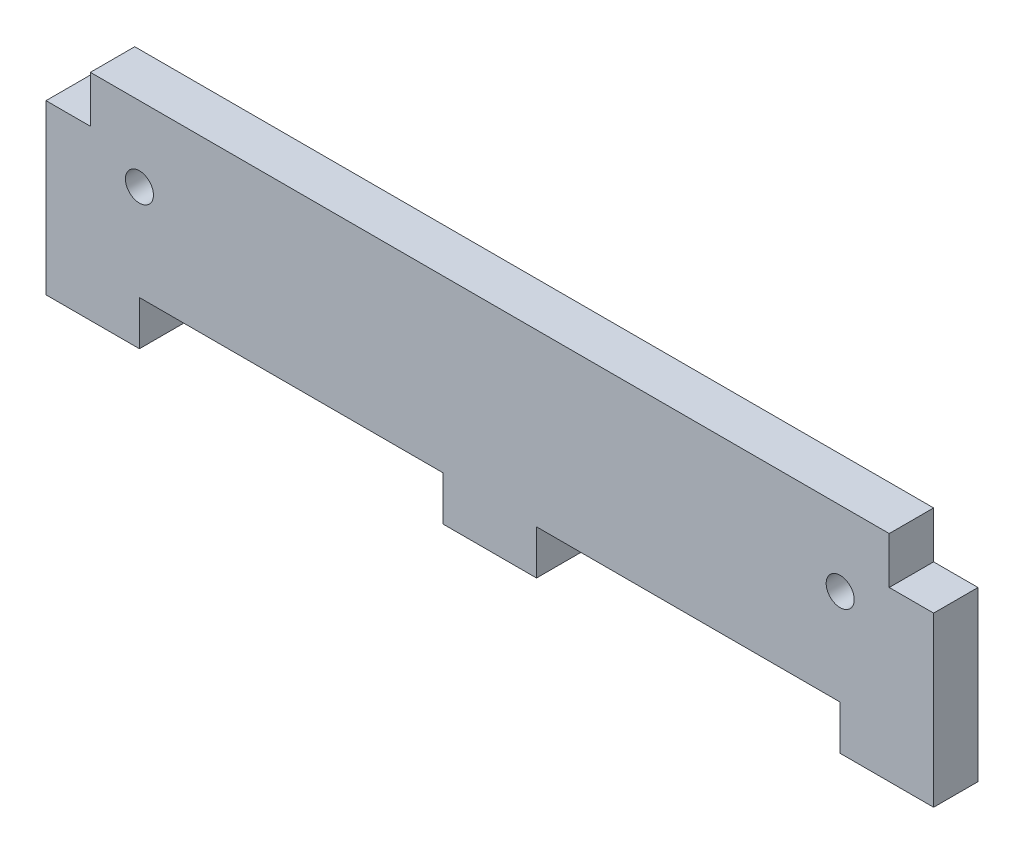
ISO-10303-21;
HEADER;
FILE_DESCRIPTION(('STEP AP214'),'2;1');
FILE_NAME('part.step','',(''),(''),'','','');
FILE_SCHEMA(('AUTOMOTIVE_DESIGN { 1 0 10303 214 1 1 1 1 }'));
ENDSEC;
DATA;
#1=APPLICATION_CONTEXT('core data for automotive mechanical design processes');
#2=APPLICATION_PROTOCOL_DEFINITION('international standard','automotive_design',2000,#1);
#3=PRODUCT_CONTEXT('',#1,'mechanical');
#4=PRODUCT('Part','Part','',(#3));
#5=PRODUCT_RELATED_PRODUCT_CATEGORY('part','',(#4));
#6=PRODUCT_DEFINITION_FORMATION('','',#4);
#7=PRODUCT_DEFINITION_CONTEXT('part definition',#1,'design');
#8=PRODUCT_DEFINITION('design','',#6,#7);
#9=PRODUCT_DEFINITION_SHAPE('','',#8);
#10=(LENGTH_UNIT() NAMED_UNIT(*) SI_UNIT(.MILLI.,.METRE.));
#11=(NAMED_UNIT(*) PLANE_ANGLE_UNIT() SI_UNIT($,.RADIAN.));
#12=(NAMED_UNIT(*) SI_UNIT($,.STERADIAN.) SOLID_ANGLE_UNIT());
#13=UNCERTAINTY_MEASURE_WITH_UNIT(LENGTH_MEASURE(1.E-05),#10,'distance_accuracy_value','');
#14=(GEOMETRIC_REPRESENTATION_CONTEXT(3) GLOBAL_UNCERTAINTY_ASSIGNED_CONTEXT((#13)) GLOBAL_UNIT_ASSIGNED_CONTEXT((#10,
#11,#12)) REPRESENTATION_CONTEXT('',''));
#15=CARTESIAN_POINT('',(0.,0.,0.));
#16=DIRECTION('',(0.,0.,1.));
#17=DIRECTION('',(1.,0.,0.));
#18=AXIS2_PLACEMENT_3D('',#15,#16,#17);
#19=CARTESIAN_POINT('',(0.,0.,4.75));
#20=DIRECTION('',(0.,1.,0.));
#21=DIRECTION('',(0.,0.,1.));
#22=AXIS2_PLACEMENT_3D('',#19,#20,#21);
#23=PLANE('',#22);
#24=DIRECTION('',(1.,0.,0.));
#25=VECTOR('',#24,1.);
#26=CARTESIAN_POINT('',(0.,0.,0.));
#27=LINE('',#26,#25);
#28=CARTESIAN_POINT('',(0.,0.,0.));
#29=VERTEX_POINT('',#28);
#30=CARTESIAN_POINT('',(10.,0.,0.));
#31=VERTEX_POINT('',#30);
#32=EDGE_CURVE('E166',#29,#31,#27,.T.);
#33=ORIENTED_EDGE('',*,*,#32,.T.);
#34=DIRECTION('',(0.,0.,1.));
#35=VECTOR('',#34,1.);
#36=CARTESIAN_POINT('',(10.,0.,0.));
#37=LINE('',#36,#35);
#38=CARTESIAN_POINT('',(10.,0.,4.75));
#39=VERTEX_POINT('',#38);
#40=EDGE_CURVE('E231',#31,#39,#37,.T.);
#41=ORIENTED_EDGE('',*,*,#40,.T.);
#42=DIRECTION('',(1.,0.,0.));
#43=VECTOR('',#42,1.);
#44=CARTESIAN_POINT('',(0.,0.,4.75));
#45=LINE('',#44,#43);
#46=CARTESIAN_POINT('',(0.,0.,4.75));
#47=VERTEX_POINT('',#46);
#48=EDGE_CURVE('E195',#47,#39,#45,.T.);
#49=ORIENTED_EDGE('',*,*,#48,.F.);
#50=DIRECTION('',(0.,0.,-1.));
#51=VECTOR('',#50,1.);
#52=CARTESIAN_POINT('',(0.,0.,4.75));
#53=LINE('',#52,#51);
#54=EDGE_CURVE('E11',#47,#29,#53,.T.);
#55=ORIENTED_EDGE('',*,*,#54,.T.);
#56=EDGE_LOOP('',(#33,#41,#49,#55));
#57=FACE_BOUND('',#56,.T.);
#58=ADVANCED_FACE('F32',(#57),#23,.F.);
#59=CARTESIAN_POINT('',(42.5,0.,4.75));
#60=VERTEX_POINT('',#59);
#61=CARTESIAN_POINT('',(52.5,0.,4.75));
#62=VERTEX_POINT('',#61);
#63=EDGE_CURVE('E198',#60,#62,#45,.T.);
#64=ORIENTED_EDGE('',*,*,#63,.F.);
#65=DIRECTION('',(0.,0.,1.));
#66=VECTOR('',#65,1.);
#67=CARTESIAN_POINT('',(42.5,0.,0.));
#68=LINE('',#67,#66);
#69=CARTESIAN_POINT('',(42.5,0.,0.));
#70=VERTEX_POINT('',#69);
#71=EDGE_CURVE('E234',#70,#60,#68,.T.);
#72=ORIENTED_EDGE('',*,*,#71,.F.);
#73=CARTESIAN_POINT('',(52.5,0.,0.));
#74=VERTEX_POINT('',#73);
#75=EDGE_CURVE('E170',#70,#74,#27,.T.);
#76=ORIENTED_EDGE('',*,*,#75,.T.);
#77=DIRECTION('',(0.,0.,1.));
#78=VECTOR('',#77,1.);
#79=CARTESIAN_POINT('',(52.5,0.,0.));
#80=LINE('',#79,#78);
#81=EDGE_CURVE('E203',#74,#62,#80,.T.);
#82=ORIENTED_EDGE('',*,*,#81,.T.);
#83=EDGE_LOOP('',(#64,#72,#76,#82));
#84=FACE_BOUND('',#83,.T.);
#85=ADVANCED_FACE('F316',(#84),#23,.F.);
#86=CARTESIAN_POINT('',(0.,0.,4.75));
#87=DIRECTION('',(1.,0.,0.));
#88=DIRECTION('',(0.,0.,-1.));
#89=AXIS2_PLACEMENT_3D('',#86,#87,#88);
#90=PLANE('',#89);
#91=DIRECTION('',(0.,-1.,0.));
#92=VECTOR('',#91,1.);
#93=CARTESIAN_POINT('',(0.,0.,4.75));
#94=LINE('',#93,#92);
#95=CARTESIAN_POINT('',(0.,18.,4.75));
#96=VERTEX_POINT('',#95);
#97=EDGE_CURVE('E160',#96,#47,#94,.T.);
#98=ORIENTED_EDGE('',*,*,#97,.F.);
#99=DIRECTION('',(0.,0.,1.));
#100=VECTOR('',#99,1.);
#101=CARTESIAN_POINT('',(0.,18.,0.));
#102=LINE('',#101,#100);
#103=CARTESIAN_POINT('',(0.,18.,0.));
#104=VERTEX_POINT('',#103);
#105=EDGE_CURVE('E148',#104,#96,#102,.T.);
#106=ORIENTED_EDGE('',*,*,#105,.F.);
#107=DIRECTION('',(0.,-1.,0.));
#108=VECTOR('',#107,1.);
#109=CARTESIAN_POINT('',(0.,0.,0.));
#110=LINE('',#109,#108);
#111=EDGE_CURVE('E158',#104,#29,#110,.T.);
#112=ORIENTED_EDGE('',*,*,#111,.T.);
#113=ORIENTED_EDGE('',*,*,#54,.F.);
#114=EDGE_LOOP('',(#98,#106,#112,#113));
#115=FACE_BOUND('',#114,.T.);
#116=ADVANCED_FACE('F34',(#115),#90,.F.);
#117=CARTESIAN_POINT('',(85.,0.,4.75));
#118=VERTEX_POINT('',#117);
#119=CARTESIAN_POINT('',(95.,0.,4.75));
#120=VERTEX_POINT('',#119);
#121=EDGE_CURVE('E200',#118,#120,#45,.T.);
#122=ORIENTED_EDGE('',*,*,#121,.F.);
#123=DIRECTION('',(0.,0.,1.));
#124=VECTOR('',#123,1.);
#125=CARTESIAN_POINT('',(85.,0.,0.));
#126=LINE('',#125,#124);
#127=CARTESIAN_POINT('',(85.,0.,0.));
#128=VERTEX_POINT('',#127);
#129=EDGE_CURVE('E206',#128,#118,#126,.T.);
#130=ORIENTED_EDGE('',*,*,#129,.F.);
#131=CARTESIAN_POINT('',(95.,0.,0.));
#132=VERTEX_POINT('',#131);
#133=EDGE_CURVE('E167',#128,#132,#27,.T.);
#134=ORIENTED_EDGE('',*,*,#133,.T.);
#135=DIRECTION('',(0.,0.,-1.));
#136=VECTOR('',#135,1.);
#137=CARTESIAN_POINT('',(95.,0.,4.75));
#138=LINE('',#137,#136);
#139=EDGE_CURVE('E40',#120,#132,#138,.T.);
#140=ORIENTED_EDGE('',*,*,#139,.F.);
#141=EDGE_LOOP('',(#122,#130,#134,#140));
#142=FACE_BOUND('',#141,.T.);
#143=ADVANCED_FACE('F299',(#142),#23,.F.);
#144=CARTESIAN_POINT('',(95.,0.,4.75));
#145=DIRECTION('',(-1.,0.,0.));
#146=DIRECTION('',(0.,0.,1.));
#147=AXIS2_PLACEMENT_3D('',#144,#145,#146);
#148=PLANE('',#147);
#149=DIRECTION('',(0.,1.,0.));
#150=VECTOR('',#149,1.);
#151=CARTESIAN_POINT('',(95.,0.,0.));
#152=LINE('',#151,#150);
#153=CARTESIAN_POINT('',(95.,18.,0.));
#154=VERTEX_POINT('',#153);
#155=EDGE_CURVE('E178',#132,#154,#152,.T.);
#156=ORIENTED_EDGE('',*,*,#155,.T.);
#157=DIRECTION('',(0.,0.,1.));
#158=VECTOR('',#157,1.);
#159=CARTESIAN_POINT('',(95.,18.,0.));
#160=LINE('',#159,#158);
#161=CARTESIAN_POINT('',(95.,18.,4.75));
#162=VERTEX_POINT('',#161);
#163=EDGE_CURVE('E268',#154,#162,#160,.T.);
#164=ORIENTED_EDGE('',*,*,#163,.T.);
#165=DIRECTION('',(0.,1.,0.));
#166=VECTOR('',#165,1.);
#167=CARTESIAN_POINT('',(95.,0.,4.75));
#168=LINE('',#167,#166);
#169=EDGE_CURVE('E189',#120,#162,#168,.T.);
#170=ORIENTED_EDGE('',*,*,#169,.F.);
#171=ORIENTED_EDGE('',*,*,#139,.T.);
#172=EDGE_LOOP('',(#156,#164,#170,#171));
#173=FACE_BOUND('',#172,.T.);
#174=ADVANCED_FACE('F294',(#173),#148,.F.);
#175=CARTESIAN_POINT('',(0.,23.,4.75));
#176=DIRECTION('',(0.,-1.,0.));
#177=DIRECTION('',(0.,0.,-1.));
#178=AXIS2_PLACEMENT_3D('',#175,#176,#177);
#179=PLANE('',#178);
#180=DIRECTION('',(-1.,0.,0.));
#181=VECTOR('',#180,1.);
#182=CARTESIAN_POINT('',(0.,23.,0.));
#183=LINE('',#182,#181);
#184=CARTESIAN_POINT('',(90.25,23.,0.));
#185=VERTEX_POINT('',#184);
#186=CARTESIAN_POINT('',(4.75,23.,0.));
#187=VERTEX_POINT('',#186);
#188=EDGE_CURVE('E181',#185,#187,#183,.T.);
#189=ORIENTED_EDGE('',*,*,#188,.T.);
#190=DIRECTION('',(0.,0.,1.));
#191=VECTOR('',#190,1.);
#192=CARTESIAN_POINT('',(4.75,23.,0.));
#193=LINE('',#192,#191);
#194=CARTESIAN_POINT('',(4.75,23.,4.75));
#195=VERTEX_POINT('',#194);
#196=EDGE_CURVE('E256',#187,#195,#193,.T.);
#197=ORIENTED_EDGE('',*,*,#196,.T.);
#198=DIRECTION('',(-1.,0.,0.));
#199=VECTOR('',#198,1.);
#200=CARTESIAN_POINT('',(0.,23.,4.75));
#201=LINE('',#200,#199);
#202=CARTESIAN_POINT('',(90.25,23.,4.75));
#203=VERTEX_POINT('',#202);
#204=EDGE_CURVE('E175',#203,#195,#201,.T.);
#205=ORIENTED_EDGE('',*,*,#204,.F.);
#206=DIRECTION('',(0.,0.,1.));
#207=VECTOR('',#206,1.);
#208=CARTESIAN_POINT('',(90.25,23.,0.));
#209=LINE('',#208,#207);
#210=EDGE_CURVE('E264',#185,#203,#209,.T.);
#211=ORIENTED_EDGE('',*,*,#210,.F.);
#212=EDGE_LOOP('',(#189,#197,#205,#211));
#213=FACE_BOUND('',#212,.T.);
#214=ADVANCED_FACE('F289',(#213),#179,.F.);
#215=CARTESIAN_POINT('',(0.,0.,4.75));
#216=DIRECTION('',(0.,0.,-1.));
#217=DIRECTION('',(-1.,0.,0.));
#218=AXIS2_PLACEMENT_3D('',#215,#216,#217);
#219=PLANE('',#218);
#220=CARTESIAN_POINT('',(9.99999999999999,15.,4.75));
#221=DIRECTION('',(0.,0.,1.));
#222=DIRECTION('',(1.,0.,0.));
#223=AXIS2_PLACEMENT_3D('',#220,#221,#222);
#224=CIRCLE('',#223,1.5);
#225=CARTESIAN_POINT('',(11.5,15.,4.75));
#226=VERTEX_POINT('',#225);
#227=EDGE_CURVE('E259',#226,#226,#224,.T.);
#228=ORIENTED_EDGE('',*,*,#227,.F.);
#229=EDGE_LOOP('',(#228));
#230=FACE_BOUND('',#229,.T.);
#231=CARTESIAN_POINT('',(85.,15.,4.75));
#232=DIRECTION('',(0.,0.,1.));
#233=DIRECTION('',(1.,0.,0.));
#234=AXIS2_PLACEMENT_3D('',#231,#232,#233);
#235=CIRCLE('',#234,1.5);
#236=CARTESIAN_POINT('',(86.5,15.,4.75));
#237=VERTEX_POINT('',#236);
#238=EDGE_CURVE('E252',#237,#237,#235,.T.);
#239=ORIENTED_EDGE('',*,*,#238,.F.);
#240=EDGE_LOOP('',(#239));
#241=FACE_BOUND('',#240,.T.);
#242=ORIENTED_EDGE('',*,*,#204,.T.);
#243=DIRECTION('',(0.,1.,0.));
#244=VECTOR('',#243,1.);
#245=CARTESIAN_POINT('',(4.75,23.,4.75));
#246=LINE('',#245,#244);
#247=CARTESIAN_POINT('',(4.75,18.,4.75));
#248=VERTEX_POINT('',#247);
#249=EDGE_CURVE('E153',#248,#195,#246,.T.);
#250=ORIENTED_EDGE('',*,*,#249,.F.);
#251=DIRECTION('',(1.,0.,0.));
#252=VECTOR('',#251,1.);
#253=CARTESIAN_POINT('',(0.,18.,4.75));
#254=LINE('',#253,#252);
#255=EDGE_CURVE('E271',#96,#248,#254,.T.);
#256=ORIENTED_EDGE('',*,*,#255,.F.);
#257=ORIENTED_EDGE('',*,*,#97,.T.);
#258=ORIENTED_EDGE('',*,*,#48,.T.);
#259=DIRECTION('',(0.,-1.,0.));
#260=VECTOR('',#259,1.);
#261=CARTESIAN_POINT('',(10.,0.,4.75));
#262=LINE('',#261,#260);
#263=CARTESIAN_POINT('',(10.,4.75,4.75));
#264=VERTEX_POINT('',#263);
#265=EDGE_CURVE('E213',#264,#39,#262,.T.);
#266=ORIENTED_EDGE('',*,*,#265,.F.);
#267=DIRECTION('',(-1.,0.,0.));
#268=VECTOR('',#267,1.);
#269=CARTESIAN_POINT('',(10.,4.75,4.75));
#270=LINE('',#269,#268);
#271=CARTESIAN_POINT('',(42.5,4.75,4.75));
#272=VERTEX_POINT('',#271);
#273=EDGE_CURVE('E238',#272,#264,#270,.T.);
#274=ORIENTED_EDGE('',*,*,#273,.F.);
#275=DIRECTION('',(0.,1.,0.));
#276=VECTOR('',#275,1.);
#277=CARTESIAN_POINT('',(42.5,0.,4.75));
#278=LINE('',#277,#276);
#279=EDGE_CURVE('E242',#60,#272,#278,.T.);
#280=ORIENTED_EDGE('',*,*,#279,.F.);
#281=ORIENTED_EDGE('',*,*,#63,.T.);
#282=DIRECTION('',(0.,-1.,0.));
#283=VECTOR('',#282,1.);
#284=CARTESIAN_POINT('',(52.5,0.,4.75));
#285=LINE('',#284,#283);
#286=CARTESIAN_POINT('',(52.5,4.75,4.75));
#287=VERTEX_POINT('',#286);
#288=EDGE_CURVE('E221',#287,#62,#285,.T.);
#289=ORIENTED_EDGE('',*,*,#288,.F.);
#290=DIRECTION('',(-1.,0.,0.));
#291=VECTOR('',#290,1.);
#292=CARTESIAN_POINT('',(52.5,4.75,4.75));
#293=LINE('',#292,#291);
#294=CARTESIAN_POINT('',(85.,4.75,4.75));
#295=VERTEX_POINT('',#294);
#296=EDGE_CURVE('E214',#295,#287,#293,.T.);
#297=ORIENTED_EDGE('',*,*,#296,.F.);
#298=DIRECTION('',(0.,1.,0.));
#299=VECTOR('',#298,1.);
#300=CARTESIAN_POINT('',(85.,0.,4.75));
#301=LINE('',#300,#299);
#302=EDGE_CURVE('E218',#118,#295,#301,.T.);
#303=ORIENTED_EDGE('',*,*,#302,.F.);
#304=ORIENTED_EDGE('',*,*,#121,.T.);
#305=ORIENTED_EDGE('',*,*,#169,.T.);
#306=DIRECTION('',(1.,0.,0.));
#307=VECTOR('',#306,1.);
#308=CARTESIAN_POINT('',(95.,18.,4.75));
#309=LINE('',#308,#307);
#310=CARTESIAN_POINT('',(90.25,18.,4.75));
#311=VERTEX_POINT('',#310);
#312=EDGE_CURVE('E272',#311,#162,#309,.T.);
#313=ORIENTED_EDGE('',*,*,#312,.F.);
#314=DIRECTION('',(0.,-1.,0.));
#315=VECTOR('',#314,1.);
#316=CARTESIAN_POINT('',(90.25,23.,4.75));
#317=LINE('',#316,#315);
#318=EDGE_CURVE('E275',#203,#311,#317,.T.);
#319=ORIENTED_EDGE('',*,*,#318,.F.);
#320=EDGE_LOOP('',(#242,#250,#256,#257,#258,#266,#274,#280,#281,#289,#297,#303,#304,#305,#313,#319));
#321=FACE_BOUND('',#320,.T.);
#322=ADVANCED_FACE('F292',(#230,#241,#321),#219,.F.);
#323=CARTESIAN_POINT('',(0.,0.,0.));
#324=DIRECTION('',(0.,0.,-1.));
#325=DIRECTION('',(-1.,0.,0.));
#326=AXIS2_PLACEMENT_3D('',#323,#324,#325);
#327=PLANE('',#326);
#328=DIRECTION('',(0.,1.,0.));
#329=VECTOR('',#328,1.);
#330=CARTESIAN_POINT('',(4.75,23.,0.));
#331=LINE('',#330,#329);
#332=CARTESIAN_POINT('',(4.75,18.,0.));
#333=VERTEX_POINT('',#332);
#334=EDGE_CURVE('E47',#333,#187,#331,.T.);
#335=ORIENTED_EDGE('',*,*,#334,.T.);
#336=ORIENTED_EDGE('',*,*,#188,.F.);
#337=DIRECTION('',(0.,-1.,0.));
#338=VECTOR('',#337,1.);
#339=CARTESIAN_POINT('',(90.25,23.,0.));
#340=LINE('',#339,#338);
#341=CARTESIAN_POINT('',(90.25,18.,0.));
#342=VERTEX_POINT('',#341);
#343=EDGE_CURVE('E274',#185,#342,#340,.T.);
#344=ORIENTED_EDGE('',*,*,#343,.T.);
#345=DIRECTION('',(1.,0.,0.));
#346=VECTOR('',#345,1.);
#347=CARTESIAN_POINT('',(95.,18.,0.));
#348=LINE('',#347,#346);
#349=EDGE_CURVE('E55',#342,#154,#348,.T.);
#350=ORIENTED_EDGE('',*,*,#349,.T.);
#351=ORIENTED_EDGE('',*,*,#155,.F.);
#352=ORIENTED_EDGE('',*,*,#133,.F.);
#353=DIRECTION('',(0.,1.,0.));
#354=VECTOR('',#353,1.);
#355=CARTESIAN_POINT('',(85.,0.,0.));
#356=LINE('',#355,#354);
#357=CARTESIAN_POINT('',(85.,4.75,0.));
#358=VERTEX_POINT('',#357);
#359=EDGE_CURVE('E226',#128,#358,#356,.T.);
#360=ORIENTED_EDGE('',*,*,#359,.T.);
#361=DIRECTION('',(-1.,0.,0.));
#362=VECTOR('',#361,1.);
#363=CARTESIAN_POINT('',(52.5,4.75,0.));
#364=LINE('',#363,#362);
#365=CARTESIAN_POINT('',(52.5,4.75,0.));
#366=VERTEX_POINT('',#365);
#367=EDGE_CURVE('E207',#358,#366,#364,.T.);
#368=ORIENTED_EDGE('',*,*,#367,.T.);
#369=DIRECTION('',(0.,-1.,0.));
#370=VECTOR('',#369,1.);
#371=CARTESIAN_POINT('',(52.5,0.,0.));
#372=LINE('',#371,#370);
#373=EDGE_CURVE('E217',#366,#74,#372,.T.);
#374=ORIENTED_EDGE('',*,*,#373,.T.);
#375=ORIENTED_EDGE('',*,*,#75,.F.);
#376=DIRECTION('',(0.,1.,0.));
#377=VECTOR('',#376,1.);
#378=CARTESIAN_POINT('',(42.5,0.,0.));
#379=LINE('',#378,#377);
#380=CARTESIAN_POINT('',(42.5,4.75,0.));
#381=VERTEX_POINT('',#380);
#382=EDGE_CURVE('E248',#70,#381,#379,.T.);
#383=ORIENTED_EDGE('',*,*,#382,.T.);
#384=DIRECTION('',(-1.,0.,0.));
#385=VECTOR('',#384,1.);
#386=CARTESIAN_POINT('',(10.,4.75,0.));
#387=LINE('',#386,#385);
#388=CARTESIAN_POINT('',(10.,4.75,0.));
#389=VERTEX_POINT('',#388);
#390=EDGE_CURVE('E235',#381,#389,#387,.T.);
#391=ORIENTED_EDGE('',*,*,#390,.T.);
#392=DIRECTION('',(0.,-1.,0.));
#393=VECTOR('',#392,1.);
#394=CARTESIAN_POINT('',(10.,0.,0.));
#395=LINE('',#394,#393);
#396=EDGE_CURVE('E241',#389,#31,#395,.T.);
#397=ORIENTED_EDGE('',*,*,#396,.T.);
#398=ORIENTED_EDGE('',*,*,#32,.F.);
#399=ORIENTED_EDGE('',*,*,#111,.F.);
#400=DIRECTION('',(1.,0.,0.));
#401=VECTOR('',#400,1.);
#402=CARTESIAN_POINT('',(0.,18.,0.));
#403=LINE('',#402,#401);
#404=EDGE_CURVE('E144',#104,#333,#403,.T.);
#405=ORIENTED_EDGE('',*,*,#404,.T.);
#406=EDGE_LOOP('',(#335,#336,#344,#350,#351,#352,#360,#368,#374,#375,#383,#391,#397,#398,#399,#405));
#407=FACE_BOUND('',#406,.T.);
#408=CARTESIAN_POINT('',(9.99999999999999,15.,0.));
#409=DIRECTION('',(0.,0.,1.));
#410=DIRECTION('',(1.,0.,0.));
#411=AXIS2_PLACEMENT_3D('',#408,#409,#410);
#412=CIRCLE('',#411,1.5);
#413=CARTESIAN_POINT('',(11.5,15.,0.));
#414=VERTEX_POINT('',#413);
#415=EDGE_CURVE('E223',#414,#414,#412,.T.);
#416=ORIENTED_EDGE('',*,*,#415,.T.);
#417=EDGE_LOOP('',(#416));
#418=FACE_BOUND('',#417,.T.);
#419=CARTESIAN_POINT('',(85.,15.,0.));
#420=DIRECTION('',(0.,0.,1.));
#421=DIRECTION('',(1.,0.,0.));
#422=AXIS2_PLACEMENT_3D('',#419,#420,#421);
#423=CIRCLE('',#422,1.5);
#424=CARTESIAN_POINT('',(86.5,15.,0.));
#425=VERTEX_POINT('',#424);
#426=EDGE_CURVE('E255',#425,#425,#423,.T.);
#427=ORIENTED_EDGE('',*,*,#426,.T.);
#428=EDGE_LOOP('',(#427));
#429=FACE_BOUND('',#428,.T.);
#430=ADVANCED_FACE('F162',(#407,#418,#429),#327,.T.);
#431=CARTESIAN_POINT('',(52.5,0.,0.));
#432=DIRECTION('',(-1.,0.,0.));
#433=DIRECTION('',(0.,0.,1.));
#434=AXIS2_PLACEMENT_3D('',#431,#432,#433);
#435=PLANE('',#434);
#436=ORIENTED_EDGE('',*,*,#288,.T.);
#437=ORIENTED_EDGE('',*,*,#81,.F.);
#438=ORIENTED_EDGE('',*,*,#373,.F.);
#439=DIRECTION('',(0.,0.,1.));
#440=VECTOR('',#439,1.);
#441=CARTESIAN_POINT('',(52.5,4.75,0.));
#442=LINE('',#441,#440);
#443=EDGE_CURVE('E211',#366,#287,#442,.T.);
#444=ORIENTED_EDGE('',*,*,#443,.T.);
#445=EDGE_LOOP('',(#436,#437,#438,#444));
#446=FACE_BOUND('',#445,.T.);
#447=ADVANCED_FACE('F369',(#446),#435,.F.);
#448=CARTESIAN_POINT('',(52.5,4.75,0.));
#449=DIRECTION('',(0.,1.,0.));
#450=DIRECTION('',(0.,0.,1.));
#451=AXIS2_PLACEMENT_3D('',#448,#449,#450);
#452=PLANE('',#451);
#453=ORIENTED_EDGE('',*,*,#296,.T.);
#454=ORIENTED_EDGE('',*,*,#443,.F.);
#455=ORIENTED_EDGE('',*,*,#367,.F.);
#456=DIRECTION('',(0.,0.,1.));
#457=VECTOR('',#456,1.);
#458=CARTESIAN_POINT('',(85.,4.75,0.));
#459=LINE('',#458,#457);
#460=EDGE_CURVE('E209',#358,#295,#459,.T.);
#461=ORIENTED_EDGE('',*,*,#460,.T.);
#462=EDGE_LOOP('',(#453,#454,#455,#461));
#463=FACE_BOUND('',#462,.T.);
#464=ADVANCED_FACE('F308',(#463),#452,.F.);
#465=CARTESIAN_POINT('',(85.,0.,0.));
#466=DIRECTION('',(1.,0.,0.));
#467=DIRECTION('',(0.,1.,0.));
#468=AXIS2_PLACEMENT_3D('',#465,#466,#467);
#469=PLANE('',#468);
#470=ORIENTED_EDGE('',*,*,#302,.T.);
#471=ORIENTED_EDGE('',*,*,#460,.F.);
#472=ORIENTED_EDGE('',*,*,#359,.F.);
#473=ORIENTED_EDGE('',*,*,#129,.T.);
#474=EDGE_LOOP('',(#470,#471,#472,#473));
#475=FACE_BOUND('',#474,.T.);
#476=ADVANCED_FACE('F302',(#475),#469,.F.);
#477=CARTESIAN_POINT('',(10.,0.,0.));
#478=DIRECTION('',(-1.,0.,0.));
#479=DIRECTION('',(0.,0.,1.));
#480=AXIS2_PLACEMENT_3D('',#477,#478,#479);
#481=PLANE('',#480);
#482=ORIENTED_EDGE('',*,*,#265,.T.);
#483=ORIENTED_EDGE('',*,*,#40,.F.);
#484=ORIENTED_EDGE('',*,*,#396,.F.);
#485=DIRECTION('',(0.,0.,1.));
#486=VECTOR('',#485,1.);
#487=CARTESIAN_POINT('',(10.,4.75,0.));
#488=LINE('',#487,#486);
#489=EDGE_CURVE('E168',#389,#264,#488,.T.);
#490=ORIENTED_EDGE('',*,*,#489,.T.);
#491=EDGE_LOOP('',(#482,#483,#484,#490));
#492=FACE_BOUND('',#491,.T.);
#493=ADVANCED_FACE('F391',(#492),#481,.F.);
#494=CARTESIAN_POINT('',(10.,4.75,0.));
#495=DIRECTION('',(0.,1.,0.));
#496=DIRECTION('',(0.,0.,1.));
#497=AXIS2_PLACEMENT_3D('',#494,#495,#496);
#498=PLANE('',#497);
#499=ORIENTED_EDGE('',*,*,#273,.T.);
#500=ORIENTED_EDGE('',*,*,#489,.F.);
#501=ORIENTED_EDGE('',*,*,#390,.F.);
#502=DIRECTION('',(0.,0.,1.));
#503=VECTOR('',#502,1.);
#504=CARTESIAN_POINT('',(42.5,4.75,0.));
#505=LINE('',#504,#503);
#506=EDGE_CURVE('E172',#381,#272,#505,.T.);
#507=ORIENTED_EDGE('',*,*,#506,.T.);
#508=EDGE_LOOP('',(#499,#500,#501,#507));
#509=FACE_BOUND('',#508,.T.);
#510=ADVANCED_FACE('F324',(#509),#498,.F.);
#511=CARTESIAN_POINT('',(42.5,0.,0.));
#512=DIRECTION('',(1.,0.,0.));
#513=DIRECTION('',(0.,0.,-1.));
#514=AXIS2_PLACEMENT_3D('',#511,#512,#513);
#515=PLANE('',#514);
#516=ORIENTED_EDGE('',*,*,#279,.T.);
#517=ORIENTED_EDGE('',*,*,#506,.F.);
#518=ORIENTED_EDGE('',*,*,#382,.F.);
#519=ORIENTED_EDGE('',*,*,#71,.T.);
#520=EDGE_LOOP('',(#516,#517,#518,#519));
#521=FACE_BOUND('',#520,.T.);
#522=ADVANCED_FACE('F319',(#521),#515,.F.);
#523=CARTESIAN_POINT('',(85.,15.,0.));
#524=DIRECTION('',(0.,0.,1.));
#525=DIRECTION('',(1.,0.,0.));
#526=AXIS2_PLACEMENT_3D('',#523,#524,#525);
#527=CYLINDRICAL_SURFACE('',#526,1.5);
#528=ORIENTED_EDGE('',*,*,#426,.F.);
#529=EDGE_LOOP('',(#528));
#530=FACE_BOUND('',#529,.T.);
#531=ORIENTED_EDGE('',*,*,#238,.T.);
#532=EDGE_LOOP('',(#531));
#533=FACE_BOUND('',#532,.T.);
#534=ADVANCED_FACE('F416',(#530,#533),#527,.F.);
#535=CARTESIAN_POINT('',(9.99999999999999,15.,0.));
#536=DIRECTION('',(0.,0.,1.));
#537=DIRECTION('',(1.,0.,0.));
#538=AXIS2_PLACEMENT_3D('',#535,#536,#537);
#539=CYLINDRICAL_SURFACE('',#538,1.5);
#540=ORIENTED_EDGE('',*,*,#415,.F.);
#541=EDGE_LOOP('',(#540));
#542=FACE_BOUND('',#541,.T.);
#543=ORIENTED_EDGE('',*,*,#227,.T.);
#544=EDGE_LOOP('',(#543));
#545=FACE_BOUND('',#544,.T.);
#546=ADVANCED_FACE('F424',(#542,#545),#539,.F.);
#547=CARTESIAN_POINT('',(95.,18.,0.));
#548=DIRECTION('',(0.,-1.,0.));
#549=DIRECTION('',(1.,0.,0.));
#550=AXIS2_PLACEMENT_3D('',#547,#548,#549);
#551=PLANE('',#550);
#552=ORIENTED_EDGE('',*,*,#312,.T.);
#553=ORIENTED_EDGE('',*,*,#163,.F.);
#554=ORIENTED_EDGE('',*,*,#349,.F.);
#555=DIRECTION('',(0.,0.,1.));
#556=VECTOR('',#555,1.);
#557=CARTESIAN_POINT('',(90.25,18.,0.));
#558=LINE('',#557,#556);
#559=EDGE_CURVE('E266',#342,#311,#558,.T.);
#560=ORIENTED_EDGE('',*,*,#559,.T.);
#561=EDGE_LOOP('',(#552,#553,#554,#560));
#562=FACE_BOUND('',#561,.T.);
#563=ADVANCED_FACE('F293',(#562),#551,.F.);
#564=CARTESIAN_POINT('',(90.25,23.,0.));
#565=DIRECTION('',(-1.,0.,0.));
#566=DIRECTION('',(0.,0.,1.));
#567=AXIS2_PLACEMENT_3D('',#564,#565,#566);
#568=PLANE('',#567);
#569=ORIENTED_EDGE('',*,*,#318,.T.);
#570=ORIENTED_EDGE('',*,*,#559,.F.);
#571=ORIENTED_EDGE('',*,*,#343,.F.);
#572=ORIENTED_EDGE('',*,*,#210,.T.);
#573=EDGE_LOOP('',(#569,#570,#571,#572));
#574=FACE_BOUND('',#573,.T.);
#575=ADVANCED_FACE('F291',(#574),#568,.F.);
#576=CARTESIAN_POINT('',(4.75,23.,0.));
#577=DIRECTION('',(1.,0.,0.));
#578=DIRECTION('',(0.,1.,0.));
#579=AXIS2_PLACEMENT_3D('',#576,#577,#578);
#580=PLANE('',#579);
#581=ORIENTED_EDGE('',*,*,#249,.T.);
#582=ORIENTED_EDGE('',*,*,#196,.F.);
#583=ORIENTED_EDGE('',*,*,#334,.F.);
#584=DIRECTION('',(0.,0.,1.));
#585=VECTOR('',#584,1.);
#586=CARTESIAN_POINT('',(4.75,18.,0.));
#587=LINE('',#586,#585);
#588=EDGE_CURVE('E150',#333,#248,#587,.T.);
#589=ORIENTED_EDGE('',*,*,#588,.T.);
#590=EDGE_LOOP('',(#581,#582,#583,#589));
#591=FACE_BOUND('',#590,.T.);
#592=ADVANCED_FACE('F329',(#591),#580,.F.);
#593=CARTESIAN_POINT('',(0.,18.,0.));
#594=DIRECTION('',(0.,-1.,0.));
#595=DIRECTION('',(0.,0.,-1.));
#596=AXIS2_PLACEMENT_3D('',#593,#594,#595);
#597=PLANE('',#596);
#598=ORIENTED_EDGE('',*,*,#255,.T.);
#599=ORIENTED_EDGE('',*,*,#588,.F.);
#600=ORIENTED_EDGE('',*,*,#404,.F.);
#601=ORIENTED_EDGE('',*,*,#105,.T.);
#602=EDGE_LOOP('',(#598,#599,#600,#601));
#603=FACE_BOUND('',#602,.T.);
#604=ADVANCED_FACE('F147',(#603),#597,.F.);
#605=CLOSED_SHELL('',(#58,#85,#116,#143,#174,#214,#322,#430,#447,#464,#476,#493,#510,#522,#534,
#546,#563,#575,#592,#604));
#606=MANIFOLD_SOLID_BREP('B2',#605);
#607=ADVANCED_BREP_SHAPE_REPRESENTATION('',(#18,#606),#14);
#608=SHAPE_DEFINITION_REPRESENTATION(#9,#607);
ENDSEC;
END-ISO-10303-21;
